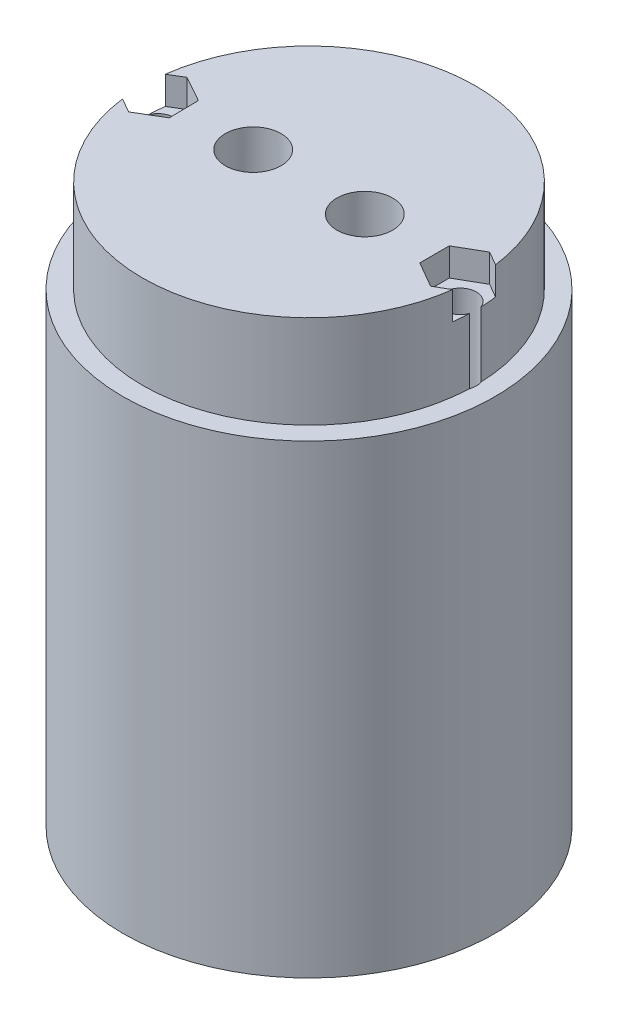
ISO-10303-21;
HEADER;
FILE_DESCRIPTION(('STEP AP214'),'2;1');
FILE_NAME('part.step','',(''),(''),'','','');
FILE_SCHEMA(('AUTOMOTIVE_DESIGN { 1 0 10303 214 1 1 1 1 }'));
ENDSEC;
DATA;
#1=APPLICATION_CONTEXT('core data for automotive mechanical design processes');
#2=APPLICATION_PROTOCOL_DEFINITION('international standard','automotive_design',2000,#1);
#3=PRODUCT_CONTEXT('',#1,'mechanical');
#4=PRODUCT('Part','Part','',(#3));
#5=PRODUCT_RELATED_PRODUCT_CATEGORY('part','',(#4));
#6=PRODUCT_DEFINITION_FORMATION('','',#4);
#7=PRODUCT_DEFINITION_CONTEXT('part definition',#1,'design');
#8=PRODUCT_DEFINITION('design','',#6,#7);
#9=PRODUCT_DEFINITION_SHAPE('','',#8);
#10=(LENGTH_UNIT() NAMED_UNIT(*) SI_UNIT(.MILLI.,.METRE.));
#11=(NAMED_UNIT(*) PLANE_ANGLE_UNIT() SI_UNIT($,.RADIAN.));
#12=(NAMED_UNIT(*) SI_UNIT($,.STERADIAN.) SOLID_ANGLE_UNIT());
#13=UNCERTAINTY_MEASURE_WITH_UNIT(LENGTH_MEASURE(1.E-05),#10,'distance_accuracy_value','');
#14=(GEOMETRIC_REPRESENTATION_CONTEXT(3) GLOBAL_UNCERTAINTY_ASSIGNED_CONTEXT((#13)) GLOBAL_UNIT_ASSIGNED_CONTEXT((#10,
#11,#12)) REPRESENTATION_CONTEXT('',''));
#15=CARTESIAN_POINT('',(0.,0.,0.));
#16=DIRECTION('',(0.,0.,1.));
#17=DIRECTION('',(1.,0.,0.));
#18=AXIS2_PLACEMENT_3D('',#15,#16,#17);
#19=CARTESIAN_POINT('',(0.536002937764703,3.6943585373721,73.6008168353316));
#20=DIRECTION('',(0.,-1.,0.));
#21=DIRECTION('',(0.,0.,-1.));
#22=AXIS2_PLACEMENT_3D('',#19,#20,#21);
#23=CYLINDRICAL_SURFACE('',#22,13.);
#24=CARTESIAN_POINT('',(0.536002937764703,-6.3056414626279,73.6008168353316));
#25=DIRECTION('',(0.,1.,0.));
#26=DIRECTION('',(0.,0.,1.));
#27=AXIS2_PLACEMENT_3D('',#24,#25,#26);
#28=CIRCLE('',#27,13.);
#29=CARTESIAN_POINT('',(0.536002937764703,-6.3056414626279,86.6008168353316));
#30=VERTEX_POINT('',#29);
#31=EDGE_CURVE('E11',#30,#30,#28,.T.);
#32=ORIENTED_EDGE('',*,*,#31,.T.);
#33=EDGE_LOOP('',(#32));
#34=FACE_BOUND('',#33,.T.);
#35=CARTESIAN_POINT('',(0.536002937764703,-21.3056414626279,73.6008168353316));
#36=DIRECTION('',(0.,-1.,0.));
#37=DIRECTION('',(0.,0.,-1.));
#38=AXIS2_PLACEMENT_3D('',#35,#36,#37);
#39=CIRCLE('',#38,13.);
#40=CARTESIAN_POINT('',(0.536002937764703,-21.3056414626279,60.6008168353316));
#41=VERTEX_POINT('',#40);
#42=EDGE_CURVE('E41',#41,#41,#39,.F.);
#43=ORIENTED_EDGE('',*,*,#42,.F.);
#44=EDGE_LOOP('',(#43));
#45=FACE_BOUND('',#44,.T.);
#46=ADVANCED_FACE('F36',(#34,#45),#23,.F.);
#47=CARTESIAN_POINT('',(0.536002937764703,-36.3056414626279,73.6008168353316));
#48=DIRECTION('',(0.,-1.,0.));
#49=DIRECTION('',(0.,0.,-1.));
#50=AXIS2_PLACEMENT_3D('',#47,#48,#49);
#51=PLANE('',#50);
#52=CARTESIAN_POINT('',(0.536002937764703,-36.3056414626279,73.6008168353316));
#53=DIRECTION('',(0.,-1.,0.));
#54=DIRECTION('',(0.,0.,-1.));
#55=AXIS2_PLACEMENT_3D('',#52,#53,#54);
#56=CIRCLE('',#55,14.);
#57=CARTESIAN_POINT('',(0.536002937764703,-36.3056414626279,59.6008168353316));
#58=VERTEX_POINT('',#57);
#59=EDGE_CURVE('E653',#58,#58,#56,.T.);
#60=ORIENTED_EDGE('',*,*,#59,.F.);
#61=EDGE_LOOP('',(#60));
#62=FACE_BOUND('',#61,.T.);
#63=CARTESIAN_POINT('',(16.7860029377647,-36.3056414626279,73.6008168353316));
#64=DIRECTION('',(0.,1.,0.));
#65=DIRECTION('',(0.,0.,1.));
#66=AXIS2_PLACEMENT_3D('',#63,#64,#65);
#67=CIRCLE('',#66,1.75);
#68=CARTESIAN_POINT('',(18.5360029377647,-36.3056414626279,73.6008168353316));
#69=VERTEX_POINT('',#68);
#70=EDGE_CURVE('E175',#69,#69,#67,.T.);
#71=ORIENTED_EDGE('',*,*,#70,.T.);
#72=CARTESIAN_POINT('',(0.536002937764707,-36.3056414626279,73.6008168353315));
#73=DIRECTION('',(0.,-1.,0.));
#74=DIRECTION('',(0.,0.,-1.));
#75=AXIS2_PLACEMENT_3D('',#72,#73,#74);
#76=CIRCLE('',#75,18.);
#77=CARTESIAN_POINT('',(-17.4639970622353,-36.3056414626279,73.6008168353316));
#78=VERTEX_POINT('',#77);
#79=EDGE_CURVE('E164',#69,#78,#76,.T.);
#80=ORIENTED_EDGE('',*,*,#79,.T.);
#81=CARTESIAN_POINT('',(-15.7139970622353,-36.3056414626279,73.6008168353316));
#82=DIRECTION('',(0.,1.,0.));
#83=DIRECTION('',(0.,0.,1.));
#84=AXIS2_PLACEMENT_3D('',#81,#82,#83);
#85=CIRCLE('',#84,1.75000000000001);
#86=EDGE_CURVE('E173',#78,#78,#85,.T.);
#87=ORIENTED_EDGE('',*,*,#86,.T.);
#88=EDGE_CURVE('E161',#78,#69,#76,.T.);
#89=ORIENTED_EDGE('',*,*,#88,.T.);
#90=EDGE_LOOP('',(#71,#80,#87,#89));
#91=FACE_BOUND('',#90,.T.);
#92=ADVANCED_FACE('F171',(#62,#91),#51,.T.);
#93=CARTESIAN_POINT('',(16.7860029377647,-36.3056414626279,73.6008168353316));
#94=DIRECTION('',(0.,1.,0.));
#95=DIRECTION('',(0.,0.,1.));
#96=AXIS2_PLACEMENT_3D('',#93,#94,#95);
#97=CYLINDRICAL_SURFACE('',#96,1.75);
#98=ORIENTED_EDGE('',*,*,#70,.F.);
#99=EDGE_LOOP('',(#98));
#100=FACE_BOUND('',#99,.T.);
#101=CARTESIAN_POINT('',(16.7860029377647,10.6943585373721,73.6008168353316));
#102=DIRECTION('',(0.,1.,0.));
#103=DIRECTION('',(0.,0.,1.));
#104=AXIS2_PLACEMENT_3D('',#101,#102,#103);
#105=CIRCLE('',#104,1.75);
#106=CARTESIAN_POINT('',(18.4255413993032,10.6943585373721,74.2127103171862));
#107=VERTEX_POINT('',#106);
#108=CARTESIAN_POINT('',(18.4255413993032,10.6943585373721,72.988923353477));
#109=VERTEX_POINT('',#108);
#110=EDGE_CURVE('E169',#107,#109,#105,.F.);
#111=ORIENTED_EDGE('',*,*,#110,.F.);
#112=DIRECTION('',(0.,1.,0.));
#113=VECTOR('',#112,1.);
#114=CARTESIAN_POINT('',(18.4255413993032,22.6943585373721,74.2127103171862));
#115=LINE('',#114,#113);
#116=CARTESIAN_POINT('',(18.4255413993032,3.6943585373721,74.2127103171862));
#117=VERTEX_POINT('',#116);
#118=EDGE_CURVE('E277',#117,#107,#115,.T.);
#119=ORIENTED_EDGE('',*,*,#118,.F.);
#120=CARTESIAN_POINT('',(16.7860029377647,3.6943585373721,73.6008168353316));
#121=DIRECTION('',(0.,-1.,0.));
#122=DIRECTION('',(0.,0.,-1.));
#123=AXIS2_PLACEMENT_3D('',#120,#121,#122);
#124=CIRCLE('',#123,1.75);
#125=CARTESIAN_POINT('',(18.4255413993032,3.6943585373721,72.988923353477));
#126=VERTEX_POINT('',#125);
#127=EDGE_CURVE('E299',#126,#117,#124,.T.);
#128=ORIENTED_EDGE('',*,*,#127,.F.);
#129=DIRECTION('',(0.,1.,0.));
#130=VECTOR('',#129,1.);
#131=CARTESIAN_POINT('',(18.4255413993032,22.6943585373721,72.988923353477));
#132=LINE('',#131,#130);
#133=EDGE_CURVE('E281',#109,#126,#132,.F.);
#134=ORIENTED_EDGE('',*,*,#133,.F.);
#135=EDGE_LOOP('',(#111,#119,#128,#134));
#136=FACE_BOUND('',#135,.T.);
#137=ADVANCED_FACE('F394',(#100,#136),#97,.F.);
#138=CARTESIAN_POINT('',(-15.7139970622353,-36.3056414626279,73.6008168353316));
#139=DIRECTION('',(0.,1.,0.));
#140=DIRECTION('',(0.,0.,1.));
#141=AXIS2_PLACEMENT_3D('',#138,#139,#140);
#142=CYLINDRICAL_SURFACE('',#141,1.75000000000001);
#143=ORIENTED_EDGE('',*,*,#86,.F.);
#144=EDGE_LOOP('',(#143));
#145=FACE_BOUND('',#144,.T.);
#146=CARTESIAN_POINT('',(-15.7139970622353,10.6943585373721,73.6008168353316));
#147=DIRECTION('',(0.,1.,0.));
#148=DIRECTION('',(0.,0.,1.));
#149=AXIS2_PLACEMENT_3D('',#146,#147,#148);
#150=CIRCLE('',#149,1.75000000000001);
#151=CARTESIAN_POINT('',(-17.3535355237738,10.6943585373721,72.988923353477));
#152=VERTEX_POINT('',#151);
#153=CARTESIAN_POINT('',(-17.3535355237738,10.6943585373721,74.2127103171862));
#154=VERTEX_POINT('',#153);
#155=EDGE_CURVE('E305',#152,#154,#150,.F.);
#156=ORIENTED_EDGE('',*,*,#155,.F.);
#157=DIRECTION('',(0.,1.,0.));
#158=VECTOR('',#157,1.);
#159=CARTESIAN_POINT('',(-17.3535355237738,22.6943585373721,72.988923353477));
#160=LINE('',#159,#158);
#161=CARTESIAN_POINT('',(-17.3535355237738,3.6943585373721,72.988923353477));
#162=VERTEX_POINT('',#161);
#163=EDGE_CURVE('E283',#162,#152,#160,.T.);
#164=ORIENTED_EDGE('',*,*,#163,.F.);
#165=CARTESIAN_POINT('',(-15.7139970622353,3.6943585373721,73.6008168353316));
#166=DIRECTION('',(0.,-1.,0.));
#167=DIRECTION('',(0.,0.,-1.));
#168=AXIS2_PLACEMENT_3D('',#165,#166,#167);
#169=CIRCLE('',#168,1.75000000000001);
#170=CARTESIAN_POINT('',(-17.3535355237738,3.6943585373721,74.2127103171862));
#171=VERTEX_POINT('',#170);
#172=EDGE_CURVE('E302',#171,#162,#169,.T.);
#173=ORIENTED_EDGE('',*,*,#172,.F.);
#174=DIRECTION('',(0.,1.,0.));
#175=VECTOR('',#174,1.);
#176=CARTESIAN_POINT('',(-17.3535355237738,22.6943585373721,74.2127103171862));
#177=LINE('',#176,#175);
#178=EDGE_CURVE('E286',#154,#171,#177,.F.);
#179=ORIENTED_EDGE('',*,*,#178,.F.);
#180=EDGE_LOOP('',(#156,#164,#173,#179));
#181=FACE_BOUND('',#180,.T.);
#182=ADVANCED_FACE('F390',(#145,#181),#142,.F.);
#183=CARTESIAN_POINT('',(0.536002937764703,3.6943585373721,73.6008168353316));
#184=DIRECTION('',(0.,1.,0.));
#185=DIRECTION('',(0.,0.,1.));
#186=AXIS2_PLACEMENT_3D('',#183,#184,#185);
#187=CYLINDRICAL_SURFACE('',#186,17.9);
#188=CARTESIAN_POINT('',(0.536002937764703,13.6943585373721,73.6008168353316));
#189=DIRECTION('',(0.,-1.,0.));
#190=DIRECTION('',(0.,0.,-1.));
#191=AXIS2_PLACEMENT_3D('',#188,#189,#190);
#192=CIRCLE('',#191,17.9);
#193=CARTESIAN_POINT('',(18.2864344022861,13.6943585373721,75.9099688059325));
#194=VERTEX_POINT('',#193);
#195=CARTESIAN_POINT('',(-17.2140453826696,13.6943585373721,75.9129121236463));
#196=VERTEX_POINT('',#195);
#197=EDGE_CURVE('E296',#194,#196,#192,.T.);
#198=ORIENTED_EDGE('',*,*,#197,.T.);
#199=DIRECTION('',(0.,1.,0.));
#200=VECTOR('',#199,1.);
#201=CARTESIAN_POINT('',(-17.2140453826696,3.6943585373721,75.9129121236463));
#202=LINE('',#201,#200);
#203=CARTESIAN_POINT('',(-17.2140453826696,10.6943585373721,75.9129121236463));
#204=VERTEX_POINT('',#203);
#205=EDGE_CURVE('E273',#196,#204,#202,.F.);
#206=ORIENTED_EDGE('',*,*,#205,.T.);
#207=CARTESIAN_POINT('',(0.536002937764703,10.6943585373721,73.6008168353316));
#208=DIRECTION('',(0.,1.,0.));
#209=DIRECTION('',(0.,0.,1.));
#210=AXIS2_PLACEMENT_3D('',#207,#208,#209);
#211=CIRCLE('',#210,17.9);
#212=EDGE_CURVE('E258',#154,#204,#211,.T.);
#213=ORIENTED_EDGE('',*,*,#212,.F.);
#214=ORIENTED_EDGE('',*,*,#178,.T.);
#215=CARTESIAN_POINT('',(0.536002937764703,3.6943585373721,73.6008168353316));
#216=DIRECTION('',(0.,-1.,0.));
#217=DIRECTION('',(0.,0.,-1.));
#218=AXIS2_PLACEMENT_3D('',#215,#216,#217);
#219=CIRCLE('',#218,17.9);
#220=EDGE_CURVE('E295',#117,#171,#219,.T.);
#221=ORIENTED_EDGE('',*,*,#220,.F.);
#222=ORIENTED_EDGE('',*,*,#118,.T.);
#223=CARTESIAN_POINT('',(0.536002937764703,10.6943585373721,73.6008168353316));
#224=DIRECTION('',(0.,1.,0.));
#225=DIRECTION('',(0.,0.,1.));
#226=AXIS2_PLACEMENT_3D('',#223,#224,#225);
#227=CIRCLE('',#226,17.9);
#228=CARTESIAN_POINT('',(18.2864344022861,10.6943585373721,75.9099688059325));
#229=VERTEX_POINT('',#228);
#230=EDGE_CURVE('E262',#229,#107,#227,.T.);
#231=ORIENTED_EDGE('',*,*,#230,.F.);
#232=DIRECTION('',(0.,1.,0.));
#233=VECTOR('',#232,1.);
#234=CARTESIAN_POINT('',(18.2864344022861,3.6943585373721,75.9099688059325));
#235=LINE('',#234,#233);
#236=EDGE_CURVE('E264',#229,#194,#235,.T.);
#237=ORIENTED_EDGE('',*,*,#236,.T.);
#238=EDGE_LOOP('',(#198,#206,#213,#214,#221,#222,#231,#237));
#239=FACE_BOUND('',#238,.T.);
#240=ADVANCED_FACE('F393',(#239),#187,.T.);
#241=CARTESIAN_POINT('',(0.536002937764703,10.6943585373721,73.6008168353316));
#242=DIRECTION('',(0.,1.,0.));
#243=DIRECTION('',(0.,0.,1.));
#244=AXIS2_PLACEMENT_3D('',#241,#242,#243);
#245=CIRCLE('',#244,17.9);
#246=CARTESIAN_POINT('',(-17.2147252627742,10.6943585373721,71.2939470187634));
#247=VERTEX_POINT('',#246);
#248=EDGE_CURVE('E216',#247,#152,#245,.T.);
#249=ORIENTED_EDGE('',*,*,#248,.F.);
#250=DIRECTION('',(0.,1.,0.));
#251=VECTOR('',#250,1.);
#252=CARTESIAN_POINT('',(-17.2147252627742,3.6943585373721,71.2939470187634));
#253=LINE('',#252,#251);
#254=CARTESIAN_POINT('',(-17.2147252627742,13.6943585373721,71.2939470187634));
#255=VERTEX_POINT('',#254);
#256=EDGE_CURVE('E270',#247,#255,#253,.T.);
#257=ORIENTED_EDGE('',*,*,#256,.T.);
#258=CARTESIAN_POINT('',(18.2864344022861,13.6943585373721,71.2916648647306));
#259=VERTEX_POINT('',#258);
#260=EDGE_CURVE('E291',#255,#259,#192,.T.);
#261=ORIENTED_EDGE('',*,*,#260,.T.);
#262=DIRECTION('',(0.,1.,0.));
#263=VECTOR('',#262,1.);
#264=CARTESIAN_POINT('',(18.2864344022861,3.6943585373721,71.2916648647306));
#265=LINE('',#264,#263);
#266=CARTESIAN_POINT('',(18.2864344022861,10.6943585373721,71.2916648647306));
#267=VERTEX_POINT('',#266);
#268=EDGE_CURVE('E267',#259,#267,#265,.F.);
#269=ORIENTED_EDGE('',*,*,#268,.T.);
#270=CARTESIAN_POINT('',(0.536002937764703,10.6943585373721,73.6008168353316));
#271=DIRECTION('',(0.,1.,0.));
#272=DIRECTION('',(0.,0.,1.));
#273=AXIS2_PLACEMENT_3D('',#270,#271,#272);
#274=CIRCLE('',#273,17.9);
#275=EDGE_CURVE('E260',#109,#267,#274,.T.);
#276=ORIENTED_EDGE('',*,*,#275,.F.);
#277=ORIENTED_EDGE('',*,*,#133,.T.);
#278=EDGE_CURVE('E292',#162,#126,#219,.T.);
#279=ORIENTED_EDGE('',*,*,#278,.F.);
#280=ORIENTED_EDGE('',*,*,#163,.T.);
#281=EDGE_LOOP('',(#249,#257,#261,#269,#276,#277,#279,#280));
#282=FACE_BOUND('',#281,.T.);
#283=ADVANCED_FACE('F411',(#282),#187,.T.);
#284=CARTESIAN_POINT('',(0.536002937764703,13.6943585373721,73.6008168353316));
#285=DIRECTION('',(0.,-1.,0.));
#286=DIRECTION('',(0.,0.,-1.));
#287=AXIS2_PLACEMENT_3D('',#284,#285,#286);
#288=PLANE('',#287);
#289=CARTESIAN_POINT('',(-5.4639970622353,13.6943585373721,73.6008168353316));
#290=DIRECTION('',(0.,-1.,0.));
#291=DIRECTION('',(0.,0.,-1.));
#292=AXIS2_PLACEMENT_3D('',#289,#290,#291);
#293=CIRCLE('',#292,3.);
#294=CARTESIAN_POINT('',(-5.4639970622353,13.6943585373721,70.6008168353316));
#295=VERTEX_POINT('',#294);
#296=EDGE_CURVE('E314',#295,#295,#293,.T.);
#297=ORIENTED_EDGE('',*,*,#296,.T.);
#298=EDGE_LOOP('',(#297));
#299=FACE_BOUND('',#298,.T.);
#300=CARTESIAN_POINT('',(6.5360029377647,13.6943585373721,73.6008168353316));
#301=DIRECTION('',(0.,-1.,0.));
#302=DIRECTION('',(0.,0.,-1.));
#303=AXIS2_PLACEMENT_3D('',#300,#301,#302);
#304=CIRCLE('',#303,3.);
#305=CARTESIAN_POINT('',(6.5360029377647,13.6943585373721,70.6008168353316));
#306=VERTEX_POINT('',#305);
#307=EDGE_CURVE('E649',#306,#306,#304,.T.);
#308=ORIENTED_EDGE('',*,*,#307,.T.);
#309=EDGE_LOOP('',(#308));
#310=FACE_BOUND('',#309,.T.);
#311=DIRECTION('',(0.85870091796801,0.,-0.512477056540971));
#312=VECTOR('',#311,1.);
#313=CARTESIAN_POINT('',(-15.6680559736387,13.6943585373721,76.775910967749));
#314=LINE('',#313,#312);
#315=CARTESIAN_POINT('',(-15.6680559736387,13.6943585373721,76.775910967749));
#316=VERTEX_POINT('',#315);
#317=CARTESIAN_POINT('',(-12.9413143398565,13.6943585373721,75.1485777517381));
#318=VERTEX_POINT('',#317);
#319=EDGE_CURVE('E209',#316,#318,#314,.T.);
#320=ORIENTED_EDGE('',*,*,#319,.F.);
#321=DIRECTION('',(0.873168608805161,0.,0.487418280942827));
#322=VECTOR('',#321,1.);
#323=CARTESIAN_POINT('',(-18.4407386960174,13.6943585373721,75.2281500513425));
#324=LINE('',#323,#322);
#325=EDGE_CURVE('E207',#196,#316,#324,.T.);
#326=ORIENTED_EDGE('',*,*,#325,.F.);
#327=ORIENTED_EDGE('',*,*,#197,.F.);
#328=DIRECTION('',(0.866025403784441,0.,-0.499999999999997));
#329=VECTOR('',#328,1.);
#330=CARTESIAN_POINT('',(16.7860029377647,13.6943585373721,76.7762433158745));
#331=LINE('',#330,#329);
#332=CARTESIAN_POINT('',(16.7860029377647,13.6943585373721,76.7762433158745));
#333=VERTEX_POINT('',#332);
#334=EDGE_CURVE('E226',#333,#194,#331,.T.);
#335=ORIENTED_EDGE('',*,*,#334,.F.);
#336=DIRECTION('',(0.866025403784441,0.,0.499999999999995));
#337=VECTOR('',#336,1.);
#338=CARTESIAN_POINT('',(14.0360029377647,13.6943585373721,75.188530075603));
#339=LINE('',#338,#337);
#340=CARTESIAN_POINT('',(14.0360029377647,13.6943585373721,75.188530075603));
#341=VERTEX_POINT('',#340);
#342=EDGE_CURVE('E246',#341,#333,#339,.T.);
#343=ORIENTED_EDGE('',*,*,#342,.F.);
#344=DIRECTION('',(0.,0.,1.));
#345=VECTOR('',#344,1.);
#346=CARTESIAN_POINT('',(14.0360029377647,13.6943585373721,72.0131035950601));
#347=LINE('',#346,#345);
#348=CARTESIAN_POINT('',(14.0360029377647,13.6943585373721,72.0131035950601));
#349=VERTEX_POINT('',#348);
#350=EDGE_CURVE('E243',#349,#341,#347,.T.);
#351=ORIENTED_EDGE('',*,*,#350,.F.);
#352=DIRECTION('',(-0.866025403784438,0.,0.500000000000001));
#353=VECTOR('',#352,1.);
#354=CARTESIAN_POINT('',(16.7860029377647,13.6943585373721,70.4253903547886));
#355=LINE('',#354,#353);
#356=CARTESIAN_POINT('',(16.7860029377647,13.6943585373721,70.4253903547886));
#357=VERTEX_POINT('',#356);
#358=EDGE_CURVE('E240',#357,#349,#355,.T.);
#359=ORIENTED_EDGE('',*,*,#358,.F.);
#360=DIRECTION('',(-0.866025403784442,0.,-0.499999999999993));
#361=VECTOR('',#360,1.);
#362=CARTESIAN_POINT('',(19.5360029377647,13.6943585373721,72.0131035950601));
#363=LINE('',#362,#361);
#364=EDGE_CURVE('E184',#259,#357,#363,.T.);
#365=ORIENTED_EDGE('',*,*,#364,.F.);
#366=ORIENTED_EDGE('',*,*,#260,.F.);
#367=DIRECTION('',(-0.858700917968007,0.,0.512477056540976));
#368=VECTOR('',#367,1.);
#369=CARTESIAN_POINT('',(-15.7599381508319,13.6943585373721,70.4257227029141));
#370=LINE('',#369,#368);
#371=CARTESIAN_POINT('',(-15.7599381508319,13.6943585373721,70.4257227029141));
#372=VERTEX_POINT('',#371);
#373=EDGE_CURVE('E204',#372,#255,#370,.T.);
#374=ORIENTED_EDGE('',*,*,#373,.F.);
#375=DIRECTION('',(-0.87316860880516,0.,-0.487418280942828));
#376=VECTOR('',#375,1.);
#377=CARTESIAN_POINT('',(-12.9872554284531,13.6943585373721,71.9734836193207));
#378=LINE('',#377,#376);
#379=CARTESIAN_POINT('',(-12.9872554284531,13.6943585373721,71.9734836193207));
#380=VERTEX_POINT('',#379);
#381=EDGE_CURVE('E201',#380,#372,#378,.T.);
#382=ORIENTED_EDGE('',*,*,#381,.F.);
#383=DIRECTION('',(-0.014467690837151,0.,-0.999895337483799));
#384=VECTOR('',#383,1.);
#385=CARTESIAN_POINT('',(-12.9413143398565,13.6943585373721,75.1485777517381));
#386=LINE('',#385,#384);
#387=EDGE_CURVE('E189',#318,#380,#386,.T.);
#388=ORIENTED_EDGE('',*,*,#387,.F.);
#389=EDGE_LOOP('',(#320,#326,#327,#335,#343,#351,#359,#365,#366,#374,#382,#388));
#390=FACE_BOUND('',#389,.T.);
#391=ADVANCED_FACE('F408',(#299,#310,#390),#288,.F.);
#392=CARTESIAN_POINT('',(0.536002937764703,-36.3056414626279,73.6008168353316));
#393=DIRECTION('',(0.,1.,0.));
#394=DIRECTION('',(0.,0.,1.));
#395=AXIS2_PLACEMENT_3D('',#392,#393,#394);
#396=CYLINDRICAL_SURFACE('',#395,20.);
#397=CARTESIAN_POINT('',(0.536002937764703,3.6943585373721,73.6008168353316));
#398=DIRECTION('',(0.,-1.,0.));
#399=DIRECTION('',(0.,0.,-1.));
#400=AXIS2_PLACEMENT_3D('',#397,#398,#399);
#401=CIRCLE('',#400,20.);
#402=CARTESIAN_POINT('',(0.536002937764703,3.6943585373721,53.6008168353316));
#403=VERTEX_POINT('',#402);
#404=EDGE_CURVE('E288',#403,#403,#401,.T.);
#405=ORIENTED_EDGE('',*,*,#404,.T.);
#406=EDGE_LOOP('',(#405));
#407=FACE_BOUND('',#406,.T.);
#408=CARTESIAN_POINT('',(0.536002937764707,-46.3056414626279,73.6008168353315));
#409=DIRECTION('',(0.,-1.,0.));
#410=DIRECTION('',(0.,0.,-1.));
#411=AXIS2_PLACEMENT_3D('',#408,#409,#410);
#412=CIRCLE('',#411,20.);
#413=CARTESIAN_POINT('',(0.536002937764707,-46.3056414626279,53.6008168353315));
#414=VERTEX_POINT('',#413);
#415=EDGE_CURVE('E178',#414,#414,#412,.T.);
#416=ORIENTED_EDGE('',*,*,#415,.F.);
#417=EDGE_LOOP('',(#416));
#418=FACE_BOUND('',#417,.T.);
#419=ADVANCED_FACE('F404',(#407,#418),#396,.T.);
#420=CARTESIAN_POINT('',(0.536002937764703,3.6943585373721,73.6008168353316));
#421=DIRECTION('',(0.,-1.,0.));
#422=DIRECTION('',(0.,0.,-1.));
#423=AXIS2_PLACEMENT_3D('',#420,#421,#422);
#424=PLANE('',#423);
#425=ORIENTED_EDGE('',*,*,#220,.T.);
#426=ORIENTED_EDGE('',*,*,#172,.T.);
#427=ORIENTED_EDGE('',*,*,#278,.T.);
#428=ORIENTED_EDGE('',*,*,#127,.T.);
#429=EDGE_LOOP('',(#425,#426,#427,#428));
#430=FACE_BOUND('',#429,.T.);
#431=ORIENTED_EDGE('',*,*,#404,.F.);
#432=EDGE_LOOP('',(#431));
#433=FACE_BOUND('',#432,.T.);
#434=ADVANCED_FACE('F360',(#430,#433),#424,.F.);
#435=CARTESIAN_POINT('',(-18.4407386960174,10.6943585373721,75.2281500513425));
#436=DIRECTION('',(-0.487418280942827,0.,0.873168608805161));
#437=DIRECTION('',(0.873168608805161,0.,0.487418280942827));
#438=AXIS2_PLACEMENT_3D('',#435,#436,#437);
#439=PLANE('',#438);
#440=ORIENTED_EDGE('',*,*,#325,.T.);
#441=DIRECTION('',(0.,1.,0.));
#442=VECTOR('',#441,1.);
#443=CARTESIAN_POINT('',(-15.6680559736387,10.6943585373721,76.775910967749));
#444=LINE('',#443,#442);
#445=CARTESIAN_POINT('',(-15.6680559736387,10.6943585373721,76.775910967749));
#446=VERTEX_POINT('',#445);
#447=EDGE_CURVE('E219',#446,#316,#444,.T.);
#448=ORIENTED_EDGE('',*,*,#447,.F.);
#449=DIRECTION('',(0.873168608805161,0.,0.487418280942827));
#450=VECTOR('',#449,1.);
#451=CARTESIAN_POINT('',(-18.4407386960174,10.6943585373721,75.2281500513425));
#452=LINE('',#451,#450);
#453=EDGE_CURVE('E192',#204,#446,#452,.T.);
#454=ORIENTED_EDGE('',*,*,#453,.F.);
#455=ORIENTED_EDGE('',*,*,#205,.F.);
#456=EDGE_LOOP('',(#440,#448,#454,#455));
#457=FACE_BOUND('',#456,.T.);
#458=ADVANCED_FACE('F357',(#457),#439,.F.);
#459=CARTESIAN_POINT('',(-15.7599381508319,10.6943585373721,70.4257227029141));
#460=DIRECTION('',(-0.512477056540976,0.,-0.858700917968007));
#461=DIRECTION('',(-0.858700917968007,0.,0.512477056540976));
#462=AXIS2_PLACEMENT_3D('',#459,#460,#461);
#463=PLANE('',#462);
#464=DIRECTION('',(-0.858700917968007,0.,0.512477056540976));
#465=VECTOR('',#464,1.);
#466=CARTESIAN_POINT('',(-15.7599381508319,10.6943585373721,70.4257227029141));
#467=LINE('',#466,#465);
#468=CARTESIAN_POINT('',(-15.7599381508319,10.6943585373721,70.4257227029141));
#469=VERTEX_POINT('',#468);
#470=EDGE_CURVE('E188',#469,#247,#467,.T.);
#471=ORIENTED_EDGE('',*,*,#470,.F.);
#472=DIRECTION('',(0.,1.,0.));
#473=VECTOR('',#472,1.);
#474=CARTESIAN_POINT('',(-15.7599381508319,10.6943585373721,70.4257227029141));
#475=LINE('',#474,#473);
#476=EDGE_CURVE('E200',#469,#372,#475,.T.);
#477=ORIENTED_EDGE('',*,*,#476,.T.);
#478=ORIENTED_EDGE('',*,*,#373,.T.);
#479=ORIENTED_EDGE('',*,*,#256,.F.);
#480=EDGE_LOOP('',(#471,#477,#478,#479));
#481=FACE_BOUND('',#480,.T.);
#482=ADVANCED_FACE('F346',(#481),#463,.F.);
#483=CARTESIAN_POINT('',(0.,10.6943585373721,0.));
#484=DIRECTION('',(0.,1.,0.));
#485=DIRECTION('',(0.,0.,1.));
#486=AXIS2_PLACEMENT_3D('',#483,#484,#485);
#487=PLANE('',#486);
#488=ORIENTED_EDGE('',*,*,#212,.T.);
#489=ORIENTED_EDGE('',*,*,#453,.T.);
#490=DIRECTION('',(0.85870091796801,0.,-0.512477056540971));
#491=VECTOR('',#490,1.);
#492=CARTESIAN_POINT('',(-15.6680559736387,10.6943585373721,76.775910967749));
#493=LINE('',#492,#491);
#494=CARTESIAN_POINT('',(-12.9413143398565,10.6943585373721,75.1485777517381));
#495=VERTEX_POINT('',#494);
#496=EDGE_CURVE('E194',#446,#495,#493,.T.);
#497=ORIENTED_EDGE('',*,*,#496,.T.);
#498=DIRECTION('',(-0.014467690837151,0.,-0.999895337483799));
#499=VECTOR('',#498,1.);
#500=CARTESIAN_POINT('',(-12.9413143398565,10.6943585373721,75.1485777517381));
#501=LINE('',#500,#499);
#502=CARTESIAN_POINT('',(-12.9872554284531,10.6943585373721,71.9734836193207));
#503=VERTEX_POINT('',#502);
#504=EDGE_CURVE('E197',#495,#503,#501,.T.);
#505=ORIENTED_EDGE('',*,*,#504,.T.);
#506=DIRECTION('',(-0.87316860880516,0.,-0.487418280942828));
#507=VECTOR('',#506,1.);
#508=CARTESIAN_POINT('',(-12.9872554284531,10.6943585373721,71.9734836193207));
#509=LINE('',#508,#507);
#510=EDGE_CURVE('E185',#503,#469,#509,.T.);
#511=ORIENTED_EDGE('',*,*,#510,.T.);
#512=ORIENTED_EDGE('',*,*,#470,.T.);
#513=ORIENTED_EDGE('',*,*,#248,.T.);
#514=ORIENTED_EDGE('',*,*,#155,.T.);
#515=EDGE_LOOP('',(#488,#489,#497,#505,#511,#512,#513,#514));
#516=FACE_BOUND('',#515,.T.);
#517=ADVANCED_FACE('F342',(#516),#487,.T.);
#518=CARTESIAN_POINT('',(-12.9872554284531,10.6943585373721,71.9734836193207));
#519=DIRECTION('',(0.487418280942828,0.,-0.87316860880516));
#520=DIRECTION('',(-0.87316860880516,0.,-0.487418280942828));
#521=AXIS2_PLACEMENT_3D('',#518,#519,#520);
#522=PLANE('',#521);
#523=ORIENTED_EDGE('',*,*,#381,.T.);
#524=ORIENTED_EDGE('',*,*,#476,.F.);
#525=ORIENTED_EDGE('',*,*,#510,.F.);
#526=DIRECTION('',(0.,1.,0.));
#527=VECTOR('',#526,1.);
#528=CARTESIAN_POINT('',(-12.9872554284531,10.6943585373721,71.9734836193207));
#529=LINE('',#528,#527);
#530=EDGE_CURVE('E214',#503,#380,#529,.T.);
#531=ORIENTED_EDGE('',*,*,#530,.T.);
#532=EDGE_LOOP('',(#523,#524,#525,#531));
#533=FACE_BOUND('',#532,.T.);
#534=ADVANCED_FACE('F345',(#533),#522,.F.);
#535=CARTESIAN_POINT('',(-12.9413143398565,10.6943585373721,75.1485777517381));
#536=DIRECTION('',(0.999895337483799,0.,-0.014467690837151));
#537=DIRECTION('',(-0.014467690837151,0.,-0.999895337483799));
#538=AXIS2_PLACEMENT_3D('',#535,#536,#537);
#539=PLANE('',#538);
#540=ORIENTED_EDGE('',*,*,#387,.T.);
#541=ORIENTED_EDGE('',*,*,#530,.F.);
#542=ORIENTED_EDGE('',*,*,#504,.F.);
#543=DIRECTION('',(0.,1.,0.));
#544=VECTOR('',#543,1.);
#545=CARTESIAN_POINT('',(-12.9413143398565,10.6943585373721,75.1485777517381));
#546=LINE('',#545,#544);
#547=EDGE_CURVE('E217',#495,#318,#546,.T.);
#548=ORIENTED_EDGE('',*,*,#547,.T.);
#549=EDGE_LOOP('',(#540,#541,#542,#548));
#550=FACE_BOUND('',#549,.T.);
#551=ADVANCED_FACE('F348',(#550),#539,.F.);
#552=CARTESIAN_POINT('',(-15.6680559736387,10.6943585373721,76.775910967749));
#553=DIRECTION('',(0.512477056540971,0.,0.85870091796801));
#554=DIRECTION('',(0.85870091796801,0.,-0.512477056540971));
#555=AXIS2_PLACEMENT_3D('',#552,#553,#554);
#556=PLANE('',#555);
#557=ORIENTED_EDGE('',*,*,#319,.T.);
#558=ORIENTED_EDGE('',*,*,#547,.F.);
#559=ORIENTED_EDGE('',*,*,#496,.F.);
#560=ORIENTED_EDGE('',*,*,#447,.T.);
#561=EDGE_LOOP('',(#557,#558,#559,#560));
#562=FACE_BOUND('',#561,.T.);
#563=ADVANCED_FACE('F351',(#562),#556,.F.);
#564=CARTESIAN_POINT('',(19.5360029377647,10.6943585373721,72.0131035950601));
#565=DIRECTION('',(0.499999999999993,0.,-0.866025403784442));
#566=DIRECTION('',(-0.866025403784443,0.,-0.499999999999993));
#567=AXIS2_PLACEMENT_3D('',#564,#565,#566);
#568=PLANE('',#567);
#569=ORIENTED_EDGE('',*,*,#364,.T.);
#570=DIRECTION('',(0.,1.,0.));
#571=VECTOR('',#570,1.);
#572=CARTESIAN_POINT('',(16.7860029377647,10.6943585373721,70.4253903547886));
#573=LINE('',#572,#571);
#574=CARTESIAN_POINT('',(16.7860029377647,10.6943585373721,70.4253903547886));
#575=VERTEX_POINT('',#574);
#576=EDGE_CURVE('E238',#575,#357,#573,.T.);
#577=ORIENTED_EDGE('',*,*,#576,.F.);
#578=DIRECTION('',(-0.866025403784442,0.,-0.499999999999993));
#579=VECTOR('',#578,1.);
#580=CARTESIAN_POINT('',(19.5360029377647,10.6943585373721,72.0131035950601));
#581=LINE('',#580,#579);
#582=EDGE_CURVE('E223',#267,#575,#581,.T.);
#583=ORIENTED_EDGE('',*,*,#582,.F.);
#584=ORIENTED_EDGE('',*,*,#268,.F.);
#585=EDGE_LOOP('',(#569,#577,#583,#584));
#586=FACE_BOUND('',#585,.T.);
#587=ADVANCED_FACE('F355',(#586),#568,.F.);
#588=CARTESIAN_POINT('',(16.7860029377647,10.6943585373721,76.7762433158745));
#589=DIRECTION('',(0.499999999999997,0.,0.86602540378444));
#590=DIRECTION('',(0.866025403784441,0.,-0.499999999999997));
#591=AXIS2_PLACEMENT_3D('',#588,#589,#590);
#592=PLANE('',#591);
#593=DIRECTION('',(0.866025403784441,0.,-0.499999999999997));
#594=VECTOR('',#593,1.);
#595=CARTESIAN_POINT('',(16.7860029377647,10.6943585373721,76.7762433158745));
#596=LINE('',#595,#594);
#597=CARTESIAN_POINT('',(16.7860029377647,10.6943585373721,76.7762433158745));
#598=VERTEX_POINT('',#597);
#599=EDGE_CURVE('E235',#598,#229,#596,.T.);
#600=ORIENTED_EDGE('',*,*,#599,.F.);
#601=DIRECTION('',(0.,1.,0.));
#602=VECTOR('',#601,1.);
#603=CARTESIAN_POINT('',(16.7860029377647,10.6943585373721,76.7762433158745));
#604=LINE('',#603,#602);
#605=EDGE_CURVE('E205',#598,#333,#604,.T.);
#606=ORIENTED_EDGE('',*,*,#605,.T.);
#607=ORIENTED_EDGE('',*,*,#334,.T.);
#608=ORIENTED_EDGE('',*,*,#236,.F.);
#609=EDGE_LOOP('',(#600,#606,#607,#608));
#610=FACE_BOUND('',#609,.T.);
#611=ADVANCED_FACE('F372',(#610),#592,.F.);
#612=CARTESIAN_POINT('',(0.,10.6943585373721,0.));
#613=DIRECTION('',(0.,1.,0.));
#614=DIRECTION('',(0.,0.,1.));
#615=AXIS2_PLACEMENT_3D('',#612,#613,#614);
#616=PLANE('',#615);
#617=ORIENTED_EDGE('',*,*,#230,.T.);
#618=ORIENTED_EDGE('',*,*,#110,.T.);
#619=ORIENTED_EDGE('',*,*,#275,.T.);
#620=ORIENTED_EDGE('',*,*,#582,.T.);
#621=DIRECTION('',(-0.866025403784438,0.,0.500000000000001));
#622=VECTOR('',#621,1.);
#623=CARTESIAN_POINT('',(16.7860029377647,10.6943585373721,70.4253903547886));
#624=LINE('',#623,#622);
#625=CARTESIAN_POINT('',(14.0360029377647,10.6943585373721,72.0131035950601));
#626=VERTEX_POINT('',#625);
#627=EDGE_CURVE('E225',#575,#626,#624,.T.);
#628=ORIENTED_EDGE('',*,*,#627,.T.);
#629=DIRECTION('',(0.,0.,1.));
#630=VECTOR('',#629,1.);
#631=CARTESIAN_POINT('',(14.0360029377647,10.6943585373721,72.0131035950601));
#632=LINE('',#631,#630);
#633=CARTESIAN_POINT('',(14.0360029377647,10.6943585373721,75.188530075603));
#634=VERTEX_POINT('',#633);
#635=EDGE_CURVE('E229',#626,#634,#632,.T.);
#636=ORIENTED_EDGE('',*,*,#635,.T.);
#637=DIRECTION('',(0.866025403784441,0.,0.499999999999995));
#638=VECTOR('',#637,1.);
#639=CARTESIAN_POINT('',(14.0360029377647,10.6943585373721,75.188530075603));
#640=LINE('',#639,#638);
#641=EDGE_CURVE('E232',#634,#598,#640,.T.);
#642=ORIENTED_EDGE('',*,*,#641,.T.);
#643=ORIENTED_EDGE('',*,*,#599,.T.);
#644=EDGE_LOOP('',(#617,#618,#619,#620,#628,#636,#642,#643));
#645=FACE_BOUND('',#644,.T.);
#646=ADVANCED_FACE('F368',(#645),#616,.T.);
#647=CARTESIAN_POINT('',(14.0360029377647,10.6943585373721,75.188530075603));
#648=DIRECTION('',(-0.499999999999995,0.,0.866025403784441));
#649=DIRECTION('',(0.866025403784441,0.,0.499999999999995));
#650=AXIS2_PLACEMENT_3D('',#647,#648,#649);
#651=PLANE('',#650);
#652=ORIENTED_EDGE('',*,*,#342,.T.);
#653=ORIENTED_EDGE('',*,*,#605,.F.);
#654=ORIENTED_EDGE('',*,*,#641,.F.);
#655=DIRECTION('',(0.,1.,0.));
#656=VECTOR('',#655,1.);
#657=CARTESIAN_POINT('',(14.0360029377647,10.6943585373721,75.188530075603));
#658=LINE('',#657,#656);
#659=EDGE_CURVE('E251',#634,#341,#658,.T.);
#660=ORIENTED_EDGE('',*,*,#659,.T.);
#661=EDGE_LOOP('',(#652,#653,#654,#660));
#662=FACE_BOUND('',#661,.T.);
#663=ADVANCED_FACE('F371',(#662),#651,.F.);
#664=CARTESIAN_POINT('',(14.0360029377647,10.6943585373721,72.0131035950601));
#665=DIRECTION('',(-1.,0.,0.));
#666=DIRECTION('',(0.,0.,1.));
#667=AXIS2_PLACEMENT_3D('',#664,#665,#666);
#668=PLANE('',#667);
#669=ORIENTED_EDGE('',*,*,#350,.T.);
#670=ORIENTED_EDGE('',*,*,#659,.F.);
#671=ORIENTED_EDGE('',*,*,#635,.F.);
#672=DIRECTION('',(0.,1.,0.));
#673=VECTOR('',#672,1.);
#674=CARTESIAN_POINT('',(14.0360029377647,10.6943585373721,72.0131035950601));
#675=LINE('',#674,#673);
#676=EDGE_CURVE('E253',#626,#349,#675,.T.);
#677=ORIENTED_EDGE('',*,*,#676,.T.);
#678=EDGE_LOOP('',(#669,#670,#671,#677));
#679=FACE_BOUND('',#678,.T.);
#680=ADVANCED_FACE('F379',(#679),#668,.F.);
#681=CARTESIAN_POINT('',(16.7860029377647,10.6943585373721,70.4253903547886));
#682=DIRECTION('',(-0.500000000000001,0.,-0.866025403784438));
#683=DIRECTION('',(-0.866025403784438,0.,0.500000000000001));
#684=AXIS2_PLACEMENT_3D('',#681,#682,#683);
#685=PLANE('',#684);
#686=ORIENTED_EDGE('',*,*,#358,.T.);
#687=ORIENTED_EDGE('',*,*,#676,.F.);
#688=ORIENTED_EDGE('',*,*,#627,.F.);
#689=ORIENTED_EDGE('',*,*,#576,.T.);
#690=EDGE_LOOP('',(#686,#687,#688,#689));
#691=FACE_BOUND('',#690,.T.);
#692=ADVANCED_FACE('F337',(#691),#685,.F.);
#693=CARTESIAN_POINT('',(0.536002937764707,-46.3056414626279,73.6008168353315));
#694=DIRECTION('',(0.,-1.,0.));
#695=DIRECTION('',(0.,0.,-1.));
#696=AXIS2_PLACEMENT_3D('',#693,#694,#695);
#697=PLANE('',#696);
#698=ORIENTED_EDGE('',*,*,#415,.T.);
#699=EDGE_LOOP('',(#698));
#700=FACE_BOUND('',#699,.T.);
#701=CARTESIAN_POINT('',(0.536002937764707,-46.3056414626279,73.6008168353315));
#702=DIRECTION('',(0.,-1.,0.));
#703=DIRECTION('',(0.,0.,-1.));
#704=AXIS2_PLACEMENT_3D('',#701,#702,#703);
#705=CIRCLE('',#704,18.);
#706=CARTESIAN_POINT('',(0.536002937764707,-46.3056414626279,55.6008168353315));
#707=VERTEX_POINT('',#706);
#708=EDGE_CURVE('E176',#707,#707,#705,.T.);
#709=ORIENTED_EDGE('',*,*,#708,.F.);
#710=EDGE_LOOP('',(#709));
#711=FACE_BOUND('',#710,.T.);
#712=ADVANCED_FACE('F333',(#700,#711),#697,.T.);
#713=CARTESIAN_POINT('',(0.536002937764707,-46.3056414626279,73.6008168353315));
#714=DIRECTION('',(0.,1.,0.));
#715=DIRECTION('',(0.,0.,1.));
#716=AXIS2_PLACEMENT_3D('',#713,#714,#715);
#717=CYLINDRICAL_SURFACE('',#716,18.);
#718=ORIENTED_EDGE('',*,*,#708,.T.);
#719=EDGE_LOOP('',(#718));
#720=FACE_BOUND('',#719,.T.);
#721=ORIENTED_EDGE('',*,*,#79,.F.);
#722=ORIENTED_EDGE('',*,*,#88,.F.);
#723=EDGE_LOOP('',(#721,#722));
#724=FACE_BOUND('',#723,.T.);
#725=ADVANCED_FACE('F163',(#720,#724),#717,.F.);
#726=CARTESIAN_POINT('',(0.536002937764703,3.6943585373721,73.6008168353316));
#727=DIRECTION('',(0.,1.,0.));
#728=DIRECTION('',(0.,0.,1.));
#729=AXIS2_PLACEMENT_3D('',#726,#727,#728);
#730=PLANE('',#729);
#731=CARTESIAN_POINT('',(0.536002937764703,3.6943585373721,73.6008168353316));
#732=DIRECTION('',(0.,1.,0.));
#733=DIRECTION('',(0.,0.,1.));
#734=AXIS2_PLACEMENT_3D('',#731,#732,#733);
#735=CIRCLE('',#734,3.);
#736=CARTESIAN_POINT('',(-2.4639970622353,3.6943585373721,73.6008168353316));
#737=VERTEX_POINT('',#736);
#738=CARTESIAN_POINT('',(3.5360029377647,3.6943585373721,73.6008168353316));
#739=VERTEX_POINT('',#738);
#740=EDGE_CURVE('E46',#737,#739,#735,.F.);
#741=ORIENTED_EDGE('',*,*,#740,.T.);
#742=EDGE_CURVE('E168',#739,#737,#735,.F.);
#743=ORIENTED_EDGE('',*,*,#742,.T.);
#744=EDGE_LOOP('',(#741,#743));
#745=FACE_BOUND('',#744,.T.);
#746=ADVANCED_FACE('F332',(#745),#730,.F.);
#747=CARTESIAN_POINT('',(0.536002937764703,-6.3056414626279,73.6008168353316));
#748=DIRECTION('',(0.,1.,0.));
#749=DIRECTION('',(0.,0.,1.));
#750=AXIS2_PLACEMENT_3D('',#747,#748,#749);
#751=DEGENERATE_TOROIDAL_SURFACE('',#750,3.,10.,.T.);
#752=ORIENTED_EDGE('',*,*,#31,.F.);
#753=EDGE_LOOP('',(#752));
#754=FACE_BOUND('',#753,.T.);
#755=ORIENTED_EDGE('',*,*,#740,.F.);
#756=CARTESIAN_POINT('',(-7.09568892014512,2.33361892251034,71.0833614373492));
#757=CARTESIAN_POINT('',(-7.23645245040997,2.27235286256251,71.1746002897909));
#758=CARTESIAN_POINT('',(-7.37013230217313,2.21279608496423,71.2780260231757));
#759=CARTESIAN_POINT('',(-7.61959393832614,2.09962526115321,71.5074631502311));
#760=CARTESIAN_POINT('',(-7.73536824055986,2.04601370189067,71.6334839384115));
#761=CARTESIAN_POINT('',(-7.94549636497329,1.9472916717515,71.9061526651918));
#762=CARTESIAN_POINT('',(-8.03976526762296,1.90221501821916,72.0528787973274));
#763=CARTESIAN_POINT('',(-8.20228461849568,1.82368578069315,72.362931579526));
#764=CARTESIAN_POINT('',(-8.2705517539567,1.79022574269108,72.5262474971603));
#765=CARTESIAN_POINT('',(-8.37363150407743,1.73939956696894,72.8518305631929));
#766=CARTESIAN_POINT('',(-8.41055829287072,1.72101980555304,73.0132686884293));
#767=CARTESIAN_POINT('',(-8.45729178941164,1.69772432993915,73.3409505369642));
#768=CARTESIAN_POINT('',(-8.46711306654885,1.69280138262929,73.507191630059));
#769=CARTESIAN_POINT('',(-8.4594558952123,1.69662830358004,73.825829661423));
#770=CARTESIAN_POINT('',(-8.44404862360066,1.7043408667144,73.9782943046925));
#771=CARTESIAN_POINT('',(-8.39050089779294,1.73099004207546,74.2781395097034));
#772=CARTESIAN_POINT('',(-8.35236104801977,1.74992635588051,74.4255202065086));
#773=CARTESIAN_POINT('',(-8.25490179100948,1.79788342203183,74.7115480279678));
#774=CARTESIAN_POINT('',(-8.19555234056765,1.82691847758507,74.8501824341647));
#775=CARTESIAN_POINT('',(-8.05788456975514,1.8934784030184,75.1154445693463));
#776=CARTESIAN_POINT('',(-7.97956125032066,1.93100551013565,75.2420691218284));
#777=CARTESIAN_POINT('',(-7.79994012403303,2.01584261948249,75.4898615701018));
#778=CARTESIAN_POINT('',(-7.69736831550837,2.06367209284077,75.6099263326887));
#779=CARTESIAN_POINT('',(-7.4761760383089,2.16496485261777,75.8314364886038));
#780=CARTESIAN_POINT('',(-7.35754898337074,2.21843044911426,75.9328742001899));
#781=CARTESIAN_POINT('',(-7.09517130036074,2.33427694314894,76.1243257126916));
#782=CARTESIAN_POINT('',(-6.95010272245012,2.39702133339086,76.2123163531684));
#783=CARTESIAN_POINT('',(-6.64792118000312,2.52441596260406,76.362485935795));
#784=CARTESIAN_POINT('',(-6.49080370454429,2.58906690973095,76.4246551543607));
#785=CARTESIAN_POINT('',(-6.15814705488521,2.72204232642663,76.52488393397));
#786=CARTESIAN_POINT('',(-5.98207004720725,2.79034465215846,76.561199619942));
#787=CARTESIAN_POINT('',(-5.62511545513005,2.92398791505326,76.6018683640775));
#788=CARTESIAN_POINT('',(-5.44423735572418,2.98932853246561,76.6062179792641));
#789=CARTESIAN_POINT('',(-5.08328118064304,3.11438223796099,76.5820357441786));
#790=CARTESIAN_POINT('',(-4.90320233646651,3.17411168732189,76.5536029181471));
#791=CARTESIAN_POINT('',(-4.54894659728359,3.2857839349875,76.4636890127609));
#792=CARTESIAN_POINT('',(-4.37476750888299,3.33772965225299,76.4022203619643));
#793=CARTESIAN_POINT('',(-4.04849637885729,3.42893412093789,76.2516097911916));
#794=CARTESIAN_POINT('',(-3.89570699402324,3.4687629121056,76.164327029382));
#795=CARTESIAN_POINT('',(-3.60632346142664,3.53835762348166,75.9630322722247));
#796=CARTESIAN_POINT('',(-3.46972005680021,3.56812931362005,75.8490356668689));
#797=CARTESIAN_POINT('',(-3.22669867651797,3.61551189168472,75.606292700964));
#798=CARTESIAN_POINT('',(-3.1188447016165,3.63382267743369,75.4791164697782));
#799=CARTESIAN_POINT('',(-2.92537839296778,3.66213660252687,75.2080272829651));
#800=CARTESIAN_POINT('',(-2.8397640430324,3.67214049513373,75.0641158462229));
#801=CARTESIAN_POINT('',(-2.69529002503829,3.68568262732841,74.7673868596876));
#802=CARTESIAN_POINT('',(-2.63585300841099,3.6893662025434,74.6148552547465));
#803=CARTESIAN_POINT('',(-2.54254204401486,3.69355438642865,74.3020365607819));
#804=CARTESIAN_POINT('',(-2.50867085062959,3.69405865261292,74.1417486380955));
#805=CARTESIAN_POINT('',(-2.47746670942529,3.6943401067043,73.8969039356904));
#806=CARTESIAN_POINT('',(-2.47037305023887,3.69435177099112,73.8134764984243));
#807=CARTESIAN_POINT('',(-2.46317677594607,3.69436222289362,73.6462996804134));
#808=CARTESIAN_POINT('',(-2.46307424850426,3.69436101034782,73.5625502956446));
#809=CARTESIAN_POINT('',(-2.46987285894124,3.69435361606739,73.3953391162232));
#810=CARTESIAN_POINT('',(-2.47677372258422,3.69434743452733,73.3118773104379));
#811=CARTESIAN_POINT('',(-2.49751999659579,3.69415851953317,73.1458131553013));
#812=CARTESIAN_POINT('',(-2.51136788771157,3.69397572298917,73.0632111237339));
#813=CARTESIAN_POINT('',(-2.56349659816349,3.69271182552536,72.8162938977591));
#814=CARTESIAN_POINT('',(-2.61231340327527,3.69090769973638,72.6540680733548));
#815=CARTESIAN_POINT('',(-2.7364198219552,3.68221930158151,72.3403393278844));
#816=CARTESIAN_POINT('',(-2.81170274705429,3.67533631225415,72.1888337092375));
#817=CARTESIAN_POINT('',(-2.98517551374309,3.65399438370186,71.9028714233812));
#818=CARTESIAN_POINT('',(-3.08304738556846,3.63963741933242,71.7682148096617));
#819=CARTESIAN_POINT('',(-3.29893186095654,3.60213528031361,71.5175857784721));
#820=CARTESIAN_POINT('',(-3.41694325676189,3.57899063255541,71.4016122413973));
#821=CARTESIAN_POINT('',(-3.66652384595364,3.52435737640162,71.1935452606487));
#822=CARTESIAN_POINT('',(-3.79776868604578,3.49304794036667,71.1010143217492));
#823=CARTESIAN_POINT('',(-4.07168107063091,3.42254427314658,70.9387101717261));
#824=CARTESIAN_POINT('',(-4.21434987711493,3.38334917011643,70.8689394792297));
#825=CARTESIAN_POINT('',(-4.51192216623423,3.29678906560745,70.7512564664418));
#826=CARTESIAN_POINT('',(-4.6670740944136,3.24919700697963,70.704142087863));
#827=CARTESIAN_POINT('',(-4.98114636259641,3.14829354978232,70.6355653314513));
#828=CARTESIAN_POINT('',(-5.14006818117403,3.09497987727452,70.6141131939992));
#829=CARTESIAN_POINT('',(-5.46873610611838,2.98048002245557,70.5960068159859));
#830=CARTESIAN_POINT('',(-5.63847999851617,2.91900484148384,70.6011467512214));
#831=CARTESIAN_POINT('',(-5.9736967936716,2.79345868617827,70.6396233849125));
#832=CARTESIAN_POINT('',(-6.13917056356551,2.72938824576513,70.6729543114275));
#833=CARTESIAN_POINT('',(-6.44080632826851,2.60922434376831,70.76053958107));
#834=CARTESIAN_POINT('',(-6.5779656011497,2.55318720906542,70.8114749184602));
#835=CARTESIAN_POINT('',(-6.84378926055846,2.44220300220524,70.9329472494824));
#836=CARTESIAN_POINT('',(-6.97245376494846,2.38725591493127,71.0034839710802));
#837=CARTESIAN_POINT('',(-7.09568892014512,2.33361892251034,71.0833614373492));
#838=B_SPLINE_CURVE_WITH_KNOTS('',3,(#756,#757,#758,#759,#760,#761,#762,#763,#764,#765,#766,
#767,#768,#769,#770,#771,#772,#773,#774,#775,#776,#777,#778,#779,#780,#781,#782,#783,#784,#785,
#786,#787,#788,#789,#790,#791,#792,#793,#794,#795,#796,#797,#798,#799,#800,#801,#802,#803,#804,
#805,#806,#807,#808,#809,#810,#811,#812,#813,#814,#815,#816,#817,#818,#819,#820,#821,#822,#823,
#824,#825,#826,#827,#828,#829,#830,#831,#832,#833,#834,#835,#836,#837),.UNSPECIFIED.,.T.,.F.,(4,
2,2,2,2,2,2,2,2,2,2,2,2,2,2,2,2,2,2,2,2,2,2,2,2,2,2,2,2,2,2,2,2,2,2,2,2,2,2,2,4),(0.,
0.535249425569783,1.07072191392927,1.60827359870656,2.14547971357277,2.64264754325352,
3.13954808988438,3.59766048547407,4.0557607011308,4.51451240042877,4.97338509919241,
5.46632696551023,5.95947166531478,6.49982431833844,7.04038026811301,7.61462212907984,
8.18892583913855,8.76149931420007,9.33385752942208,9.87224250242329,10.41031806812,
10.9110961246738,11.4118287660994,11.9008845777687,12.3899930712969,12.6409356499474,
12.8918813752659,13.1428172745375,13.3938428455592,13.8994535048175,14.4049364788264,
14.9036967123551,15.4024270459815,15.8910196018056,16.3796662064884,16.8844498764197,
17.3894349104664,17.9289178450239,18.468290350338,18.9368951182571,19.4054933830556),.UNSPECIFIED.);
#839=EDGE_CURVE('E57',#737,#737,#838,.T.);
#840=ORIENTED_EDGE('',*,*,#839,.T.);
#841=ORIENTED_EDGE('',*,*,#742,.F.);
#842=CARTESIAN_POINT('',(4.54011678033408,3.5674728785518,71.3610761256563));
#843=CARTESIAN_POINT('',(4.41963148085589,3.59281176567723,71.4684497891959));
#844=CARTESIAN_POINT('',(4.30728495874478,3.6138456467559,71.5860647135488));
#845=CARTESIAN_POINT('',(4.10260796880018,3.64758471672365,71.8387047983539));
#846=CARTESIAN_POINT('',(4.01028771995596,3.66028566014929,71.9737387916138));
#847=CARTESIAN_POINT('',(3.84875453958968,3.67875865974163,72.2572029846196));
#848=CARTESIAN_POINT('',(3.77951970633321,3.68453729685559,72.4056203163931));
#849=CARTESIAN_POINT('',(3.66607525821176,3.69172631181599,72.7119067700415));
#850=CARTESIAN_POINT('',(3.62186874602103,3.69313614817418,72.8697770610858));
#851=CARTESIAN_POINT('',(3.57495479483047,3.69410680042387,73.1117834927242));
#852=CARTESIAN_POINT('',(3.56252662994915,3.69423509259604,73.1941519905106));
#853=CARTESIAN_POINT('',(3.54455480172208,3.69436037008129,73.3596573374958));
#854=CARTESIAN_POINT('',(3.53901118646351,3.6943573544772,73.4427941920573));
#855=CARTESIAN_POINT('',(3.53485978335604,3.69435937357425,73.609247858156));
#856=CARTESIAN_POINT('',(3.53625255037548,3.69436440891938,73.6925646835569));
#857=CARTESIAN_POINT('',(3.54595313667938,3.69434229742044,73.8587741519706));
#858=CARTESIAN_POINT('',(3.55426102008212,3.69431515027796,73.941666791043));
#859=CARTESIAN_POINT('',(3.58981498152799,3.69391211107699,74.1910252013645));
#860=CARTESIAN_POINT('',(3.62774339241902,3.69320740682427,74.3561026035166));
#861=CARTESIAN_POINT('',(3.73074762129001,3.68800204371447,74.6774011269073));
#862=CARTESIAN_POINT('',(3.79582009942066,3.68350185179066,74.8336233350178));
#863=CARTESIAN_POINT('',(3.9505020299211,3.66773668727216,75.1315397304604));
#864=CARTESIAN_POINT('',(4.03991639691342,3.65652468366579,75.2733376077857));
#865=CARTESIAN_POINT('',(4.24051665963223,3.62557111117778,75.5395049909315));
#866=CARTESIAN_POINT('',(4.35169884928864,3.60583099355673,75.6638774573315));
#867=CARTESIAN_POINT('',(4.58898218456578,3.55788444292907,75.8888677675042));
#868=CARTESIAN_POINT('',(4.71463962731209,3.52990257773728,75.9900028051879));
#869=CARTESIAN_POINT('',(4.97901724417948,3.46571099087565,76.1701344714106));
#870=CARTESIAN_POINT('',(5.11773902277712,3.42950025781623,76.2491283759705));
#871=CARTESIAN_POINT('',(5.40728388829242,3.34895502993839,76.3850820203078));
#872=CARTESIAN_POINT('',(5.55830492709111,3.30446057074156,76.4415235816143));
#873=CARTESIAN_POINT('',(5.86557457739519,3.20927698007782,76.5293110280689));
#874=CARTESIAN_POINT('',(6.02182447090201,3.15858632123591,76.5606507111192));
#875=CARTESIAN_POINT('',(6.34590284121442,3.04911612664794,76.5995142963425));
#876=CARTESIAN_POINT('',(6.51382642420784,2.99002544471962,76.6053662814979));
#877=CARTESIAN_POINT('',(6.84712363035072,2.86851026776219,76.5893059571042));
#878=CARTESIAN_POINT('',(7.01249636236627,2.80608464021383,76.5673841576649));
#879=CARTESIAN_POINT('',(7.34725401664749,2.67587315354429,76.4944393767854));
#880=CARTESIAN_POINT('',(7.51622161563278,2.6079994360038,76.4416487231544));
#881=CARTESIAN_POINT('',(7.8426767634379,2.47326535903319,76.3070673053263));
#882=CARTESIAN_POINT('',(8.00016111044811,2.40640528631673,76.2252684899438));
#883=CARTESIAN_POINT('',(8.30244362793562,2.27508950269462,76.0323758465846));
#884=CARTESIAN_POINT('',(8.44691667775227,2.21071087582899,75.9207173774369));
#885=CARTESIAN_POINT('',(8.71476431196454,2.08902464403901,75.6711961784524));
#886=CARTESIAN_POINT('',(8.83814291252686,2.03171569370068,75.5333384472635));
#887=CARTESIAN_POINT('',(9.05338401045533,1.93022294391386,75.2421311708984));
#888=CARTESIAN_POINT('',(9.14651511340239,1.88552567858149,75.0899027656867));
#889=CARTESIAN_POINT('',(9.30509250580442,1.80865065453245,74.7687753532487));
#890=CARTESIAN_POINT('',(9.37056280220161,1.7764620414531,74.5998909595269));
#891=CARTESIAN_POINT('',(9.46531353619349,1.72962913503917,74.2685123286767));
#892=CARTESIAN_POINT('',(9.49755674377589,1.71355302341995,74.107066126871));
#893=CARTESIAN_POINT('',(9.53513101337761,1.69480388886957,73.7803310224695));
#894=CARTESIAN_POINT('',(9.54047632460773,1.69212376939161,73.6150442010834));
#895=CARTESIAN_POINT('',(9.52462109307882,1.70004700005524,73.298493379446));
#896=CARTESIAN_POINT('',(9.50536820675333,1.70967577810601,73.1471019214285));
#897=CARTESIAN_POINT('',(9.44449619702266,1.73992680581751,72.8500488220373));
#898=CARTESIAN_POINT('',(9.4028769589889,1.76054911182058,72.7043872100335));
#899=CARTESIAN_POINT('',(9.29854498358052,1.81176191374421,72.4212703924111));
#900=CARTESIAN_POINT('',(9.23565272824687,1.84243717322538,72.2838971621969));
#901=CARTESIAN_POINT('',(9.09115268272995,1.91205471083281,72.0216906088059));
#902=CARTESIAN_POINT('',(9.00953957932257,1.95099933568059,71.8968608601265));
#903=CARTESIAN_POINT('',(8.82304448119206,2.03868455086578,71.6527831447965));
#904=CARTESIAN_POINT('',(8.71684167994604,2.08795312270948,71.5347356659705));
#905=CARTESIAN_POINT('',(8.48864726502649,2.19185755383159,71.3178385965624));
#906=CARTESIAN_POINT('',(8.36664912850382,2.24649562824359,71.2189969796489));
#907=CARTESIAN_POINT('',(8.09763187310837,2.36445433644782,71.0336280633891));
#908=CARTESIAN_POINT('',(7.94933696277194,2.42810685898224,70.9491598392873));
#909=CARTESIAN_POINT('',(7.64115832877534,2.55695180580923,70.8066303636553));
#910=CARTESIAN_POINT('',(7.48127064236216,2.62214475148153,70.7485781917194));
#911=CARTESIAN_POINT('',(7.14424507559444,2.75552928052257,70.6576520431106));
#912=CARTESIAN_POINT('',(6.9666439851873,2.82367755466021,70.626419069141));
#913=CARTESIAN_POINT('',(6.60738870464082,2.95659453659426,70.5962540668096));
#914=CARTESIAN_POINT('',(6.42573352396392,3.02136240525874,70.5973300207829));
#915=CARTESIAN_POINT('',(6.06509607642371,3.1445089556902,70.6325169560875));
#916=CARTESIAN_POINT('',(5.88610412057298,3.20293591772207,70.6663554635148));
#917=CARTESIAN_POINT('',(5.53509596761279,3.3116315504465,70.7668433692229));
#918=CARTESIAN_POINT('',(5.36307058189404,3.36191124859187,70.8334479165699));
#919=CARTESIAN_POINT('',(5.07987476663156,3.43930000501126,70.9745932566771));
#920=CARTESIAN_POINT('',(4.96544185480392,3.46891252408007,71.0413296918024));
#921=CARTESIAN_POINT('',(4.74551434782991,3.52249342072057,71.1900579988519));
#922=CARTESIAN_POINT('',(4.64001786221304,3.54646299395674,71.272046632437));
#923=CARTESIAN_POINT('',(4.54011678033408,3.5674728785518,71.3610761256563));
#924=B_SPLINE_CURVE_WITH_KNOTS('',3,(#842,#843,#844,#845,#846,#847,#848,#849,#850,#851,#852,
#853,#854,#855,#856,#857,#858,#859,#860,#861,#862,#863,#864,#865,#866,#867,#868,#869,#870,#871,
#872,#873,#874,#875,#876,#877,#878,#879,#880,#881,#882,#883,#884,#885,#886,#887,#888,#889,#890,
#891,#892,#893,#894,#895,#896,#897,#898,#899,#900,#901,#902,#903,#904,#905,#906,#907,#908,#909,
#910,#911,#912,#913,#914,#915,#916,#917,#918,#919,#920,#921,#922,#923),.UNSPECIFIED.,.T.,.F.,(4,
2,2,2,2,2,2,2,2,2,2,2,2,2,2,2,2,2,2,2,2,2,2,2,2,2,2,2,2,2,2,2,2,2,2,2,2,2,2,2,4),(0.,
0.489607903130157,0.979465058292705,1.46885614204997,1.95830788064832,2.20797227895551,
2.45763842110835,2.70732453535339,2.95701296476173,3.46252139466687,3.96796764434673,
4.46947659665333,4.97090023893006,5.45975793501002,5.94867574789548,6.4482575840686,
6.94796281740234,7.47999620498068,8.01221142950891,8.5783870062557,9.14471984759664,
9.72262910256772,10.3004282067258,10.8492997728631,11.3976939873487,11.8912846971875,
12.3846138988786,12.8411966249608,13.2977816910728,13.7583201006278,14.2189893791459,
14.7156945283149,15.2126054552546,15.7566776732005,16.3009367559532,16.8765133130321,
17.4522320748529,18.0232035658882,18.5933956631557,18.9994429971492,19.4054042175721),.UNSPECIFIED.);
#925=EDGE_CURVE('E52',#739,#739,#924,.T.);
#926=ORIENTED_EDGE('',*,*,#925,.T.);
#927=EDGE_LOOP('',(#755,#840,#841,#926));
#928=FACE_BOUND('',#927,.T.);
#929=ADVANCED_FACE('F38',(#754,#928),#751,.F.);
#930=CARTESIAN_POINT('',(6.5360029377647,13.6943585373721,73.6008168353316));
#931=DIRECTION('',(0.,-1.,0.));
#932=DIRECTION('',(0.,0.,-1.));
#933=AXIS2_PLACEMENT_3D('',#930,#931,#932);
#934=CYLINDRICAL_SURFACE('',#933,3.);
#935=ORIENTED_EDGE('',*,*,#307,.F.);
#936=EDGE_LOOP('',(#935));
#937=FACE_BOUND('',#936,.T.);
#938=ORIENTED_EDGE('',*,*,#925,.F.);
#939=EDGE_LOOP('',(#938));
#940=FACE_BOUND('',#939,.T.);
#941=ADVANCED_FACE('F319',(#937,#940),#934,.F.);
#942=CARTESIAN_POINT('',(-5.4639970622353,13.6943585373721,73.6008168353316));
#943=DIRECTION('',(0.,-1.,0.));
#944=DIRECTION('',(0.,0.,-1.));
#945=AXIS2_PLACEMENT_3D('',#942,#943,#944);
#946=CYLINDRICAL_SURFACE('',#945,3.);
#947=ORIENTED_EDGE('',*,*,#296,.F.);
#948=EDGE_LOOP('',(#947));
#949=FACE_BOUND('',#948,.T.);
#950=ORIENTED_EDGE('',*,*,#839,.F.);
#951=EDGE_LOOP('',(#950));
#952=FACE_BOUND('',#951,.T.);
#953=ADVANCED_FACE('F323',(#949,#952),#946,.F.);
#954=CARTESIAN_POINT('',(0.536002937764703,-21.3056414626279,73.6008168353316));
#955=DIRECTION('',(0.,-1.,0.));
#956=DIRECTION('',(0.,0.,-1.));
#957=AXIS2_PLACEMENT_3D('',#954,#955,#956);
#958=PLANE('',#957);
#959=CARTESIAN_POINT('',(0.536002937764703,-21.3056414626279,73.6008168353316));
#960=DIRECTION('',(0.,-1.,0.));
#961=DIRECTION('',(0.,0.,-1.));
#962=AXIS2_PLACEMENT_3D('',#959,#960,#961);
#963=CIRCLE('',#962,14.);
#964=CARTESIAN_POINT('',(0.536002937764703,-21.3056414626279,59.6008168353316));
#965=VERTEX_POINT('',#964);
#966=EDGE_CURVE('E650',#965,#965,#963,.T.);
#967=ORIENTED_EDGE('',*,*,#966,.T.);
#968=EDGE_LOOP('',(#967));
#969=FACE_BOUND('',#968,.T.);
#970=ORIENTED_EDGE('',*,*,#42,.T.);
#971=EDGE_LOOP('',(#970));
#972=FACE_BOUND('',#971,.T.);
#973=ADVANCED_FACE('F498',(#969,#972),#958,.T.);
#974=CARTESIAN_POINT('',(0.536002937764703,-21.3056414626279,73.6008168353316));
#975=DIRECTION('',(0.,-1.,0.));
#976=DIRECTION('',(0.,0.,-1.));
#977=AXIS2_PLACEMENT_3D('',#974,#975,#976);
#978=CYLINDRICAL_SURFACE('',#977,14.);
#979=ORIENTED_EDGE('',*,*,#966,.F.);
#980=EDGE_LOOP('',(#979));
#981=FACE_BOUND('',#980,.T.);
#982=ORIENTED_EDGE('',*,*,#59,.T.);
#983=EDGE_LOOP('',(#982));
#984=FACE_BOUND('',#983,.T.);
#985=ADVANCED_FACE('F666',(#981,#984),#978,.F.);
#986=CLOSED_SHELL('',(#46,#92,#137,#182,#240,#283,#391,#419,#434,#458,#482,#517,#534,#551,#563,
#587,#611,#646,#663,#680,#692,#712,#725,#746,#929,#941,#953,#973,#985));
#987=MANIFOLD_SOLID_BREP('B2',#986);
#988=ADVANCED_BREP_SHAPE_REPRESENTATION('',(#18,#987),#14);
#989=SHAPE_DEFINITION_REPRESENTATION(#9,#988);
ENDSEC;
END-ISO-10303-21;
